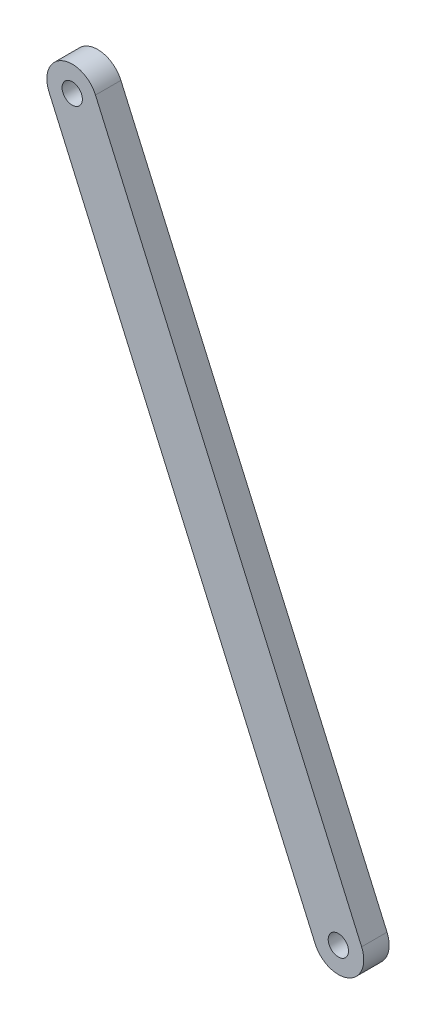
ISO-10303-21;
HEADER;
FILE_DESCRIPTION(('STEP AP214'),'2;1');
FILE_NAME('part.step','',(''),(''),'','','');
FILE_SCHEMA(('AUTOMOTIVE_DESIGN { 1 0 10303 214 1 1 1 1 }'));
ENDSEC;
DATA;
#1=APPLICATION_CONTEXT('core data for automotive mechanical design processes');
#2=APPLICATION_PROTOCOL_DEFINITION('international standard','automotive_design',2000,#1);
#3=PRODUCT_CONTEXT('',#1,'mechanical');
#4=PRODUCT('Part','Part','',(#3));
#5=PRODUCT_RELATED_PRODUCT_CATEGORY('part','',(#4));
#6=PRODUCT_DEFINITION_FORMATION('','',#4);
#7=PRODUCT_DEFINITION_CONTEXT('part definition',#1,'design');
#8=PRODUCT_DEFINITION('design','',#6,#7);
#9=PRODUCT_DEFINITION_SHAPE('','',#8);
#10=(LENGTH_UNIT() NAMED_UNIT(*) SI_UNIT(.MILLI.,.METRE.));
#11=(NAMED_UNIT(*) PLANE_ANGLE_UNIT() SI_UNIT($,.RADIAN.));
#12=(NAMED_UNIT(*) SI_UNIT($,.STERADIAN.) SOLID_ANGLE_UNIT());
#13=UNCERTAINTY_MEASURE_WITH_UNIT(LENGTH_MEASURE(1.E-05),#10,'distance_accuracy_value','');
#14=(GEOMETRIC_REPRESENTATION_CONTEXT(3) GLOBAL_UNCERTAINTY_ASSIGNED_CONTEXT((#13)) GLOBAL_UNIT_ASSIGNED_CONTEXT((#10,
#11,#12)) REPRESENTATION_CONTEXT('',''));
#15=CARTESIAN_POINT('',(0.,0.,0.));
#16=DIRECTION('',(0.,0.,1.));
#17=DIRECTION('',(1.,0.,0.));
#18=AXIS2_PLACEMENT_3D('',#15,#16,#17);
#19=CARTESIAN_POINT('',(-70.2204180554608,160.786061773559,10.));
#20=DIRECTION('',(0.,0.,1.));
#21=DIRECTION('',(1.,0.,0.));
#22=AXIS2_PLACEMENT_3D('',#19,#20,#21);
#23=PLANE('',#22);
#24=CARTESIAN_POINT('',(-70.2204180554608,160.786061773559,10.));
#25=DIRECTION('',(0.,0.,1.));
#26=DIRECTION('',(1.,0.,0.));
#27=AXIS2_PLACEMENT_3D('',#24,#25,#26);
#28=CIRCLE('',#27,2.);
#29=CARTESIAN_POINT('',(-68.2204180554608,160.786061773559,10.));
#30=VERTEX_POINT('',#29);
#31=EDGE_CURVE('E100',#30,#30,#28,.T.);
#32=ORIENTED_EDGE('',*,*,#31,.F.);
#33=EDGE_LOOP('',(#32));
#34=FACE_BOUND('',#33,.T.);
#35=CARTESIAN_POINT('',(-70.2204180554608,160.786061773559,10.));
#36=DIRECTION('',(0.,0.,1.));
#37=DIRECTION('',(1.,0.,0.));
#38=AXIS2_PLACEMENT_3D('',#35,#36,#37);
#39=CIRCLE('',#38,5.);
#40=CARTESIAN_POINT('',(-65.6440605370063,162.800249417074,10.));
#41=VERTEX_POINT('',#40);
#42=CARTESIAN_POINT('',(-74.7967755739152,158.771874130045,10.));
#43=VERTEX_POINT('',#42);
#44=EDGE_CURVE('E85',#41,#43,#39,.T.);
#45=ORIENTED_EDGE('',*,*,#44,.T.);
#46=DIRECTION('',(0.402837528702857,-0.915271503690886,0.));
#47=VECTOR('',#46,1.);
#48=CARTESIAN_POINT('',(-22.4278968425438,39.7865786502299,10.));
#49=LINE('',#48,#47);
#50=CARTESIAN_POINT('',(-22.4278968425438,39.7865786502299,10.));
#51=VERTEX_POINT('',#50);
#52=EDGE_CURVE('E80',#43,#51,#49,.T.);
#53=ORIENTED_EDGE('',*,*,#52,.T.);
#54=CARTESIAN_POINT('',(-17.8515393240893,41.8007662937442,10.));
#55=DIRECTION('',(0.,0.,1.));
#56=DIRECTION('',(1.,0.,0.));
#57=AXIS2_PLACEMENT_3D('',#54,#55,#56);
#58=CIRCLE('',#57,5.);
#59=CARTESIAN_POINT('',(-13.2751818056349,43.8149539372585,10.));
#60=VERTEX_POINT('',#59);
#61=EDGE_CURVE('E83',#51,#60,#58,.T.);
#62=ORIENTED_EDGE('',*,*,#61,.T.);
#63=DIRECTION('',(-0.402837528702857,0.915271503690886,0.));
#64=VECTOR('',#63,1.);
#65=CARTESIAN_POINT('',(-65.6440605370063,162.800249417074,10.));
#66=LINE('',#65,#64);
#67=EDGE_CURVE('E50',#60,#41,#66,.T.);
#68=ORIENTED_EDGE('',*,*,#67,.T.);
#69=EDGE_LOOP('',(#45,#53,#62,#68));
#70=FACE_BOUND('',#69,.T.);
#71=CARTESIAN_POINT('',(-17.8515393240893,41.8007662937442,10.));
#72=DIRECTION('',(0.,0.,1.));
#73=DIRECTION('',(1.,0.,0.));
#74=AXIS2_PLACEMENT_3D('',#71,#72,#73);
#75=CIRCLE('',#74,2.00000000000001);
#76=CARTESIAN_POINT('',(-15.8515393240893,41.8007662937442,10.));
#77=VERTEX_POINT('',#76);
#78=EDGE_CURVE('E115',#77,#77,#75,.T.);
#79=ORIENTED_EDGE('',*,*,#78,.F.);
#80=EDGE_LOOP('',(#79));
#81=FACE_BOUND('',#80,.T.);
#82=ADVANCED_FACE('F33',(#34,#70,#81),#23,.T.);
#83=CARTESIAN_POINT('',(-70.2204180554608,160.786061773559,5.));
#84=DIRECTION('',(0.,0.,1.));
#85=DIRECTION('',(1.,0.,0.));
#86=AXIS2_PLACEMENT_3D('',#83,#84,#85);
#87=PLANE('',#86);
#88=CARTESIAN_POINT('',(-70.2204180554608,160.786061773559,5.));
#89=DIRECTION('',(0.,0.,1.));
#90=DIRECTION('',(1.,0.,0.));
#91=AXIS2_PLACEMENT_3D('',#88,#89,#90);
#92=CIRCLE('',#91,5.);
#93=CARTESIAN_POINT('',(-65.6440605370063,162.800249417074,5.));
#94=VERTEX_POINT('',#93);
#95=CARTESIAN_POINT('',(-74.7967755739152,158.771874130045,5.));
#96=VERTEX_POINT('',#95);
#97=EDGE_CURVE('E97',#94,#96,#92,.T.);
#98=ORIENTED_EDGE('',*,*,#97,.F.);
#99=DIRECTION('',(-0.402837528702857,0.915271503690886,0.));
#100=VECTOR('',#99,1.);
#101=CARTESIAN_POINT('',(-65.6440605370063,162.800249417074,5.));
#102=LINE('',#101,#100);
#103=CARTESIAN_POINT('',(-13.2751818056349,43.8149539372585,5.));
#104=VERTEX_POINT('',#103);
#105=EDGE_CURVE('E73',#104,#94,#102,.T.);
#106=ORIENTED_EDGE('',*,*,#105,.F.);
#107=CARTESIAN_POINT('',(-17.8515393240893,41.8007662937442,5.));
#108=DIRECTION('',(0.,0.,1.));
#109=DIRECTION('',(1.,0.,0.));
#110=AXIS2_PLACEMENT_3D('',#107,#108,#109);
#111=CIRCLE('',#110,5.);
#112=CARTESIAN_POINT('',(-22.4278968425438,39.7865786502299,5.));
#113=VERTEX_POINT('',#112);
#114=EDGE_CURVE('E67',#113,#104,#111,.T.);
#115=ORIENTED_EDGE('',*,*,#114,.F.);
#116=DIRECTION('',(0.402837528702857,-0.915271503690886,0.));
#117=VECTOR('',#116,1.);
#118=CARTESIAN_POINT('',(-22.4278968425438,39.7865786502299,5.));
#119=LINE('',#118,#117);
#120=EDGE_CURVE('E89',#96,#113,#119,.T.);
#121=ORIENTED_EDGE('',*,*,#120,.F.);
#122=EDGE_LOOP('',(#98,#106,#115,#121));
#123=FACE_BOUND('',#122,.T.);
#124=CARTESIAN_POINT('',(-70.2204180554608,160.786061773559,5.));
#125=DIRECTION('',(0.,0.,1.));
#126=DIRECTION('',(1.,0.,0.));
#127=AXIS2_PLACEMENT_3D('',#124,#125,#126);
#128=CIRCLE('',#127,2.);
#129=CARTESIAN_POINT('',(-68.2204180554608,160.786061773559,5.));
#130=VERTEX_POINT('',#129);
#131=EDGE_CURVE('E112',#130,#130,#128,.T.);
#132=ORIENTED_EDGE('',*,*,#131,.T.);
#133=EDGE_LOOP('',(#132));
#134=FACE_BOUND('',#133,.T.);
#135=CARTESIAN_POINT('',(-17.8515393240893,41.8007662937442,5.));
#136=DIRECTION('',(0.,0.,1.));
#137=DIRECTION('',(1.,0.,0.));
#138=AXIS2_PLACEMENT_3D('',#135,#136,#137);
#139=CIRCLE('',#138,2.00000000000001);
#140=CARTESIAN_POINT('',(-15.8515393240893,41.8007662937442,5.));
#141=VERTEX_POINT('',#140);
#142=EDGE_CURVE('E118',#141,#141,#139,.T.);
#143=ORIENTED_EDGE('',*,*,#142,.T.);
#144=EDGE_LOOP('',(#143));
#145=FACE_BOUND('',#144,.T.);
#146=ADVANCED_FACE('F108',(#123,#134,#145),#87,.F.);
#147=CARTESIAN_POINT('',(-70.2204180554608,160.786061773559,10.));
#148=DIRECTION('',(0.,0.,-1.));
#149=DIRECTION('',(-1.,0.,0.));
#150=AXIS2_PLACEMENT_3D('',#147,#148,#149);
#151=CYLINDRICAL_SURFACE('',#150,5.);
#152=ORIENTED_EDGE('',*,*,#97,.T.);
#153=DIRECTION('',(0.,0.,-1.));
#154=VECTOR('',#153,1.);
#155=CARTESIAN_POINT('',(-74.7967755739152,158.771874130045,10.));
#156=LINE('',#155,#154);
#157=EDGE_CURVE('E11',#43,#96,#156,.T.);
#158=ORIENTED_EDGE('',*,*,#157,.F.);
#159=ORIENTED_EDGE('',*,*,#44,.F.);
#160=DIRECTION('',(0.,0.,-1.));
#161=VECTOR('',#160,1.);
#162=CARTESIAN_POINT('',(-65.6440605370063,162.800249417074,10.));
#163=LINE('',#162,#161);
#164=EDGE_CURVE('E93',#41,#94,#163,.T.);
#165=ORIENTED_EDGE('',*,*,#164,.T.);
#166=EDGE_LOOP('',(#152,#158,#159,#165));
#167=FACE_BOUND('',#166,.T.);
#168=ADVANCED_FACE('F35',(#167),#151,.T.);
#169=CARTESIAN_POINT('',(-22.4278968425438,39.7865786502299,10.));
#170=DIRECTION('',(0.915271503690886,0.402837528702857,0.));
#171=DIRECTION('',(-0.402837528702857,0.915271503690886,0.));
#172=AXIS2_PLACEMENT_3D('',#169,#170,#171);
#173=PLANE('',#172);
#174=ORIENTED_EDGE('',*,*,#120,.T.);
#175=DIRECTION('',(0.,0.,-1.));
#176=VECTOR('',#175,1.);
#177=CARTESIAN_POINT('',(-22.4278968425438,39.7865786502299,10.));
#178=LINE('',#177,#176);
#179=EDGE_CURVE('E42',#51,#113,#178,.T.);
#180=ORIENTED_EDGE('',*,*,#179,.F.);
#181=ORIENTED_EDGE('',*,*,#52,.F.);
#182=ORIENTED_EDGE('',*,*,#157,.T.);
#183=EDGE_LOOP('',(#174,#180,#181,#182));
#184=FACE_BOUND('',#183,.T.);
#185=ADVANCED_FACE('F88',(#184),#173,.F.);
#186=CARTESIAN_POINT('',(-17.8515393240893,41.8007662937442,10.));
#187=DIRECTION('',(0.,0.,-1.));
#188=DIRECTION('',(-1.,0.,0.));
#189=AXIS2_PLACEMENT_3D('',#186,#187,#188);
#190=CYLINDRICAL_SURFACE('',#189,5.);
#191=ORIENTED_EDGE('',*,*,#114,.T.);
#192=DIRECTION('',(0.,0.,-1.));
#193=VECTOR('',#192,1.);
#194=CARTESIAN_POINT('',(-13.2751818056349,43.8149539372585,10.));
#195=LINE('',#194,#193);
#196=EDGE_CURVE('E90',#60,#104,#195,.T.);
#197=ORIENTED_EDGE('',*,*,#196,.F.);
#198=ORIENTED_EDGE('',*,*,#61,.F.);
#199=ORIENTED_EDGE('',*,*,#179,.T.);
#200=EDGE_LOOP('',(#191,#197,#198,#199));
#201=FACE_BOUND('',#200,.T.);
#202=ADVANCED_FACE('F91',(#201),#190,.T.);
#203=CARTESIAN_POINT('',(-65.6440605370063,162.800249417074,10.));
#204=DIRECTION('',(-0.915271503690886,-0.402837528702857,0.));
#205=DIRECTION('',(0.402837528702857,-0.915271503690886,0.));
#206=AXIS2_PLACEMENT_3D('',#203,#204,#205);
#207=PLANE('',#206);
#208=ORIENTED_EDGE('',*,*,#105,.T.);
#209=ORIENTED_EDGE('',*,*,#164,.F.);
#210=ORIENTED_EDGE('',*,*,#67,.F.);
#211=ORIENTED_EDGE('',*,*,#196,.T.);
#212=EDGE_LOOP('',(#208,#209,#210,#211));
#213=FACE_BOUND('',#212,.T.);
#214=ADVANCED_FACE('F105',(#213),#207,.F.);
#215=CARTESIAN_POINT('',(-70.2204180554608,160.786061773559,10.));
#216=DIRECTION('',(0.,0.,-1.));
#217=DIRECTION('',(-1.,0.,0.));
#218=AXIS2_PLACEMENT_3D('',#215,#216,#217);
#219=CYLINDRICAL_SURFACE('',#218,2.);
#220=ORIENTED_EDGE('',*,*,#31,.T.);
#221=EDGE_LOOP('',(#220));
#222=FACE_BOUND('',#221,.T.);
#223=ORIENTED_EDGE('',*,*,#131,.F.);
#224=EDGE_LOOP('',(#223));
#225=FACE_BOUND('',#224,.T.);
#226=ADVANCED_FACE('F135',(#222,#225),#219,.F.);
#227=CARTESIAN_POINT('',(-17.8515393240893,41.8007662937442,10.));
#228=DIRECTION('',(0.,0.,-1.));
#229=DIRECTION('',(-1.,0.,0.));
#230=AXIS2_PLACEMENT_3D('',#227,#228,#229);
#231=CYLINDRICAL_SURFACE('',#230,2.00000000000001);
#232=ORIENTED_EDGE('',*,*,#78,.T.);
#233=EDGE_LOOP('',(#232));
#234=FACE_BOUND('',#233,.T.);
#235=ORIENTED_EDGE('',*,*,#142,.F.);
#236=EDGE_LOOP('',(#235));
#237=FACE_BOUND('',#236,.T.);
#238=ADVANCED_FACE('F124',(#234,#237),#231,.F.);
#239=CLOSED_SHELL('',(#82,#146,#168,#185,#202,#214,#226,#238));
#240=MANIFOLD_SOLID_BREP('B2',#239);
#241=ADVANCED_BREP_SHAPE_REPRESENTATION('',(#18,#240),#14);
#242=SHAPE_DEFINITION_REPRESENTATION(#9,#241);
ENDSEC;
END-ISO-10303-21;
